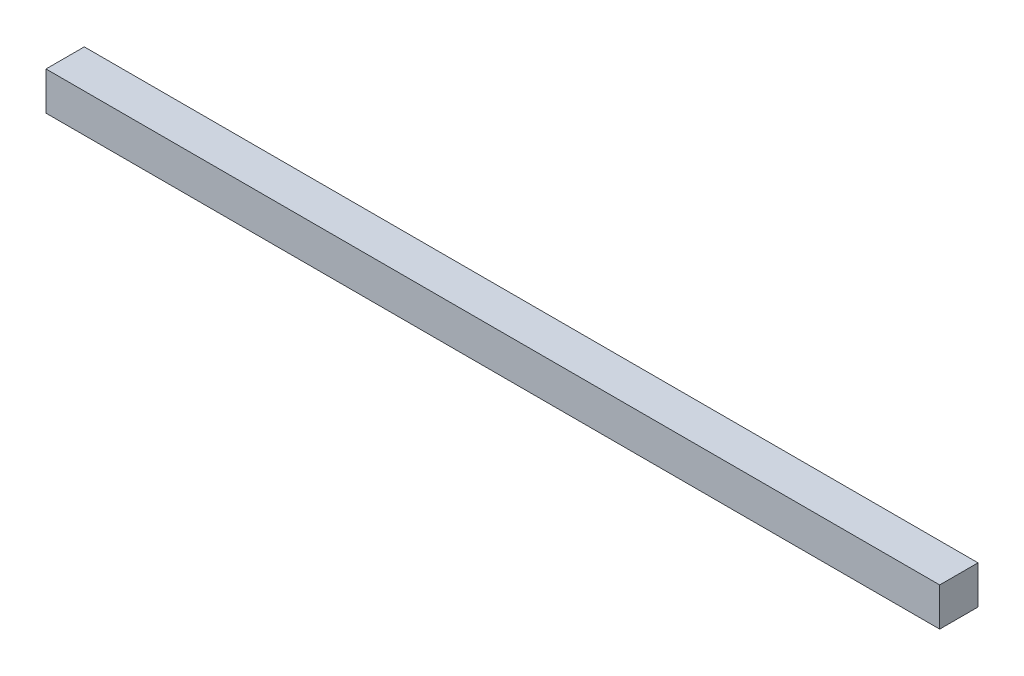
ISO-10303-21;
HEADER;
FILE_DESCRIPTION(('STEP AP214'),'2;1');
FILE_NAME('part.step','',(''),(''),'','','');
FILE_SCHEMA(('AUTOMOTIVE_DESIGN { 1 0 10303 214 1 1 1 1 }'));
ENDSEC;
DATA;
#1=APPLICATION_CONTEXT('core data for automotive mechanical design processes');
#2=APPLICATION_PROTOCOL_DEFINITION('international standard','automotive_design',2000,#1);
#3=PRODUCT_CONTEXT('',#1,'mechanical');
#4=PRODUCT('Part','Part','',(#3));
#5=PRODUCT_RELATED_PRODUCT_CATEGORY('part','',(#4));
#6=PRODUCT_DEFINITION_FORMATION('','',#4);
#7=PRODUCT_DEFINITION_CONTEXT('part definition',#1,'design');
#8=PRODUCT_DEFINITION('design','',#6,#7);
#9=PRODUCT_DEFINITION_SHAPE('','',#8);
#10=(LENGTH_UNIT() NAMED_UNIT(*) SI_UNIT(.MILLI.,.METRE.));
#11=(NAMED_UNIT(*) PLANE_ANGLE_UNIT() SI_UNIT($,.RADIAN.));
#12=(NAMED_UNIT(*) SI_UNIT($,.STERADIAN.) SOLID_ANGLE_UNIT());
#13=UNCERTAINTY_MEASURE_WITH_UNIT(LENGTH_MEASURE(1.E-05),#10,'distance_accuracy_value','');
#14=(GEOMETRIC_REPRESENTATION_CONTEXT(3) GLOBAL_UNCERTAINTY_ASSIGNED_CONTEXT((#13)) GLOBAL_UNIT_ASSIGNED_CONTEXT((#10,
#11,#12)) REPRESENTATION_CONTEXT('',''));
#15=CARTESIAN_POINT('',(0.,0.,0.));
#16=DIRECTION('',(0.,0.,1.));
#17=DIRECTION('',(1.,0.,0.));
#18=AXIS2_PLACEMENT_3D('',#15,#16,#17);
#19=CARTESIAN_POINT('',(0.,3.,0.));
#20=DIRECTION('',(1.,0.,0.));
#21=DIRECTION('',(0.,0.,-1.));
#22=AXIS2_PLACEMENT_3D('',#19,#20,#21);
#23=PLANE('',#22);
#24=DIRECTION('',(0.,0.,1.));
#25=VECTOR('',#24,1.);
#26=CARTESIAN_POINT('',(0.,0.,0.));
#27=LINE('',#26,#25);
#28=CARTESIAN_POINT('',(0.,0.,-3.));
#29=VERTEX_POINT('',#28);
#30=CARTESIAN_POINT('',(0.,0.,0.));
#31=VERTEX_POINT('',#30);
#32=EDGE_CURVE('E96',#29,#31,#27,.T.);
#33=ORIENTED_EDGE('',*,*,#32,.T.);
#34=DIRECTION('',(0.,-1.,0.));
#35=VECTOR('',#34,1.);
#36=CARTESIAN_POINT('',(0.,3.,0.));
#37=LINE('',#36,#35);
#38=CARTESIAN_POINT('',(0.,3.,0.));
#39=VERTEX_POINT('',#38);
#40=EDGE_CURVE('E11',#39,#31,#37,.T.);
#41=ORIENTED_EDGE('',*,*,#40,.F.);
#42=DIRECTION('',(0.,0.,1.));
#43=VECTOR('',#42,1.);
#44=CARTESIAN_POINT('',(0.,3.,0.));
#45=LINE('',#44,#43);
#46=CARTESIAN_POINT('',(0.,3.,-3.));
#47=VERTEX_POINT('',#46);
#48=EDGE_CURVE('E84',#47,#39,#45,.T.);
#49=ORIENTED_EDGE('',*,*,#48,.F.);
#50=DIRECTION('',(0.,-1.,0.));
#51=VECTOR('',#50,1.);
#52=CARTESIAN_POINT('',(0.,3.,-3.));
#53=LINE('',#52,#51);
#54=EDGE_CURVE('E92',#47,#29,#53,.T.);
#55=ORIENTED_EDGE('',*,*,#54,.T.);
#56=EDGE_LOOP('',(#33,#41,#49,#55));
#57=FACE_BOUND('',#56,.T.);
#58=ADVANCED_FACE('F33',(#57),#23,.F.);
#59=CARTESIAN_POINT('',(0.,3.,0.));
#60=DIRECTION('',(0.,0.,-1.));
#61=DIRECTION('',(-1.,0.,0.));
#62=AXIS2_PLACEMENT_3D('',#59,#60,#61);
#63=PLANE('',#62);
#64=DIRECTION('',(1.,0.,0.));
#65=VECTOR('',#64,1.);
#66=CARTESIAN_POINT('',(0.,0.,0.));
#67=LINE('',#66,#65);
#68=CARTESIAN_POINT('',(70.,0.,0.));
#69=VERTEX_POINT('',#68);
#70=EDGE_CURVE('E88',#31,#69,#67,.T.);
#71=ORIENTED_EDGE('',*,*,#70,.T.);
#72=DIRECTION('',(0.,-1.,0.));
#73=VECTOR('',#72,1.);
#74=CARTESIAN_POINT('',(70.,3.,0.));
#75=LINE('',#74,#73);
#76=CARTESIAN_POINT('',(70.,3.,0.));
#77=VERTEX_POINT('',#76);
#78=EDGE_CURVE('E41',#77,#69,#75,.T.);
#79=ORIENTED_EDGE('',*,*,#78,.F.);
#80=DIRECTION('',(1.,0.,0.));
#81=VECTOR('',#80,1.);
#82=CARTESIAN_POINT('',(0.,3.,0.));
#83=LINE('',#82,#81);
#84=EDGE_CURVE('E79',#39,#77,#83,.T.);
#85=ORIENTED_EDGE('',*,*,#84,.F.);
#86=ORIENTED_EDGE('',*,*,#40,.T.);
#87=EDGE_LOOP('',(#71,#79,#85,#86));
#88=FACE_BOUND('',#87,.T.);
#89=ADVANCED_FACE('F87',(#88),#63,.F.);
#90=CARTESIAN_POINT('',(70.,3.,0.));
#91=DIRECTION('',(-1.,0.,0.));
#92=DIRECTION('',(0.,0.,1.));
#93=AXIS2_PLACEMENT_3D('',#90,#91,#92);
#94=PLANE('',#93);
#95=DIRECTION('',(0.,0.,-1.));
#96=VECTOR('',#95,1.);
#97=CARTESIAN_POINT('',(70.,0.,0.));
#98=LINE('',#97,#96);
#99=CARTESIAN_POINT('',(70.,0.,-3.));
#100=VERTEX_POINT('',#99);
#101=EDGE_CURVE('E66',#69,#100,#98,.T.);
#102=ORIENTED_EDGE('',*,*,#101,.T.);
#103=DIRECTION('',(0.,-1.,0.));
#104=VECTOR('',#103,1.);
#105=CARTESIAN_POINT('',(70.,3.,-3.));
#106=LINE('',#105,#104);
#107=CARTESIAN_POINT('',(70.,3.,-3.));
#108=VERTEX_POINT('',#107);
#109=EDGE_CURVE('E89',#108,#100,#106,.T.);
#110=ORIENTED_EDGE('',*,*,#109,.F.);
#111=DIRECTION('',(0.,0.,-1.));
#112=VECTOR('',#111,1.);
#113=CARTESIAN_POINT('',(70.,3.,0.));
#114=LINE('',#113,#112);
#115=EDGE_CURVE('E82',#77,#108,#114,.T.);
#116=ORIENTED_EDGE('',*,*,#115,.F.);
#117=ORIENTED_EDGE('',*,*,#78,.T.);
#118=EDGE_LOOP('',(#102,#110,#116,#117));
#119=FACE_BOUND('',#118,.T.);
#120=ADVANCED_FACE('F90',(#119),#94,.F.);
#121=CARTESIAN_POINT('',(0.,3.,-3.));
#122=DIRECTION('',(0.,0.,1.));
#123=DIRECTION('',(1.,0.,0.));
#124=AXIS2_PLACEMENT_3D('',#121,#122,#123);
#125=PLANE('',#124);
#126=DIRECTION('',(-1.,0.,0.));
#127=VECTOR('',#126,1.);
#128=CARTESIAN_POINT('',(0.,0.,-3.));
#129=LINE('',#128,#127);
#130=EDGE_CURVE('E72',#100,#29,#129,.T.);
#131=ORIENTED_EDGE('',*,*,#130,.T.);
#132=ORIENTED_EDGE('',*,*,#54,.F.);
#133=DIRECTION('',(-1.,0.,0.));
#134=VECTOR('',#133,1.);
#135=CARTESIAN_POINT('',(0.,3.,-3.));
#136=LINE('',#135,#134);
#137=EDGE_CURVE('E49',#108,#47,#136,.T.);
#138=ORIENTED_EDGE('',*,*,#137,.F.);
#139=ORIENTED_EDGE('',*,*,#109,.T.);
#140=EDGE_LOOP('',(#131,#132,#138,#139));
#141=FACE_BOUND('',#140,.T.);
#142=ADVANCED_FACE('F103',(#141),#125,.F.);
#143=CARTESIAN_POINT('',(0.,3.,0.));
#144=DIRECTION('',(0.,-1.,0.));
#145=DIRECTION('',(0.,0.,-1.));
#146=AXIS2_PLACEMENT_3D('',#143,#144,#145);
#147=PLANE('',#146);
#148=ORIENTED_EDGE('',*,*,#48,.T.);
#149=ORIENTED_EDGE('',*,*,#84,.T.);
#150=ORIENTED_EDGE('',*,*,#115,.T.);
#151=ORIENTED_EDGE('',*,*,#137,.T.);
#152=EDGE_LOOP('',(#148,#149,#150,#151));
#153=FACE_BOUND('',#152,.T.);
#154=ADVANCED_FACE('F80',(#153),#147,.F.);
#155=CARTESIAN_POINT('',(0.,0.,0.));
#156=DIRECTION('',(0.,-1.,0.));
#157=DIRECTION('',(0.,0.,-1.));
#158=AXIS2_PLACEMENT_3D('',#155,#156,#157);
#159=PLANE('',#158);
#160=ORIENTED_EDGE('',*,*,#32,.F.);
#161=ORIENTED_EDGE('',*,*,#130,.F.);
#162=ORIENTED_EDGE('',*,*,#101,.F.);
#163=ORIENTED_EDGE('',*,*,#70,.F.);
#164=EDGE_LOOP('',(#160,#161,#162,#163));
#165=FACE_BOUND('',#164,.T.);
#166=ADVANCED_FACE('F106',(#165),#159,.T.);
#167=CLOSED_SHELL('',(#58,#89,#120,#142,#154,#166));
#168=MANIFOLD_SOLID_BREP('B2',#167);
#169=ADVANCED_BREP_SHAPE_REPRESENTATION('',(#18,#168),#14);
#170=SHAPE_DEFINITION_REPRESENTATION(#9,#169);
ENDSEC;
END-ISO-10303-21;
